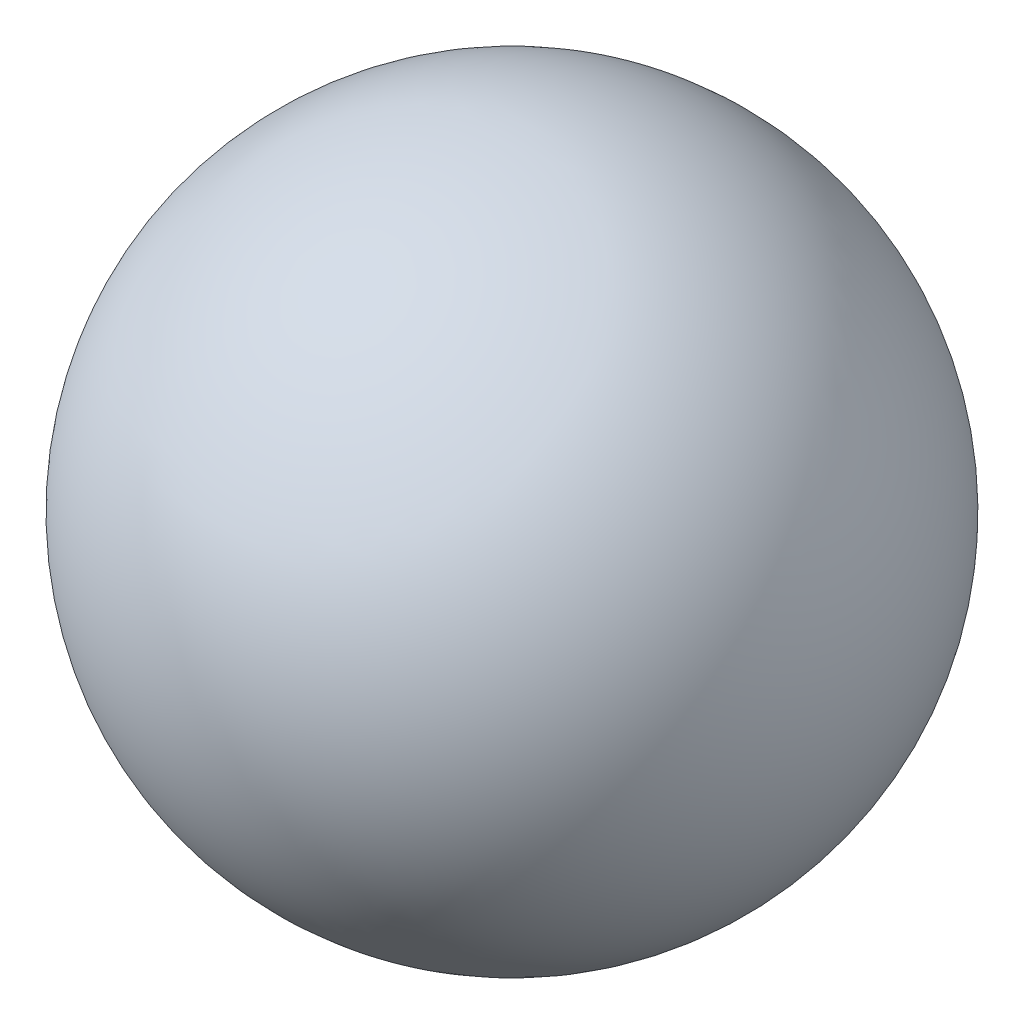
ISO-10303-21;
HEADER;
FILE_DESCRIPTION(('STEP AP214'),'2;1');
FILE_NAME('part.step','',(''),(''),'','','');
FILE_SCHEMA(('AUTOMOTIVE_DESIGN { 1 0 10303 214 1 1 1 1 }'));
ENDSEC;
DATA;
#1=APPLICATION_CONTEXT('core data for automotive mechanical design processes');
#2=APPLICATION_PROTOCOL_DEFINITION('international standard','automotive_design',2000,#1);
#3=PRODUCT_CONTEXT('',#1,'mechanical');
#4=PRODUCT('Part','Part','',(#3));
#5=PRODUCT_RELATED_PRODUCT_CATEGORY('part','',(#4));
#6=PRODUCT_DEFINITION_FORMATION('','',#4);
#7=PRODUCT_DEFINITION_CONTEXT('part definition',#1,'design');
#8=PRODUCT_DEFINITION('design','',#6,#7);
#9=PRODUCT_DEFINITION_SHAPE('','',#8);
#10=(LENGTH_UNIT() NAMED_UNIT(*) SI_UNIT(.MILLI.,.METRE.));
#11=(NAMED_UNIT(*) PLANE_ANGLE_UNIT() SI_UNIT($,.RADIAN.));
#12=(NAMED_UNIT(*) SI_UNIT($,.STERADIAN.) SOLID_ANGLE_UNIT());
#13=UNCERTAINTY_MEASURE_WITH_UNIT(LENGTH_MEASURE(1.E-05),#10,'distance_accuracy_value','');
#14=(GEOMETRIC_REPRESENTATION_CONTEXT(3) GLOBAL_UNCERTAINTY_ASSIGNED_CONTEXT((#13)) GLOBAL_UNIT_ASSIGNED_CONTEXT((#10,
#11,#12)) REPRESENTATION_CONTEXT('',''));
#15=CARTESIAN_POINT('',(0.,0.,0.));
#16=DIRECTION('',(0.,0.,1.));
#17=DIRECTION('',(1.,0.,0.));
#18=AXIS2_PLACEMENT_3D('',#15,#16,#17);
#19=CARTESIAN_POINT('',(64.16,-65.5771608423181,22.6635536679652));
#20=DIRECTION('',(0.,-0.945147382533446,0.326644187595885));
#21=DIRECTION('',(0.173648177666934,-0.321681728420802,-0.930788470058132));
#22=AXIS2_PLACEMENT_3D('',#19,#20,#21);
#23=SPHERICAL_SURFACE('',#22,7.15);
#24=CARTESIAN_POINT('',(64.16,-72.3349646274322,24.9990596092758));
#25=VERTEX_POINT('',#24);
#26=VERTEX_LOOP('',#25);
#27=FACE_BOUND('',#26,.T.);
#28=CARTESIAN_POINT('',(64.16,-58.819357057204,20.3280477266546));
#29=VERTEX_POINT('',#28);
#30=VERTEX_LOOP('',#29);
#31=FACE_BOUND('',#30,.T.);
#32=ADVANCED_FACE('F15',(#27,#31),#23,.T.);
#33=CLOSED_SHELL('',(#32));
#34=MANIFOLD_SOLID_BREP('B1',#33);
#35=ADVANCED_BREP_SHAPE_REPRESENTATION('',(#18,#34),#14);
#36=SHAPE_DEFINITION_REPRESENTATION(#9,#35);
ENDSEC;
END-ISO-10303-21;
